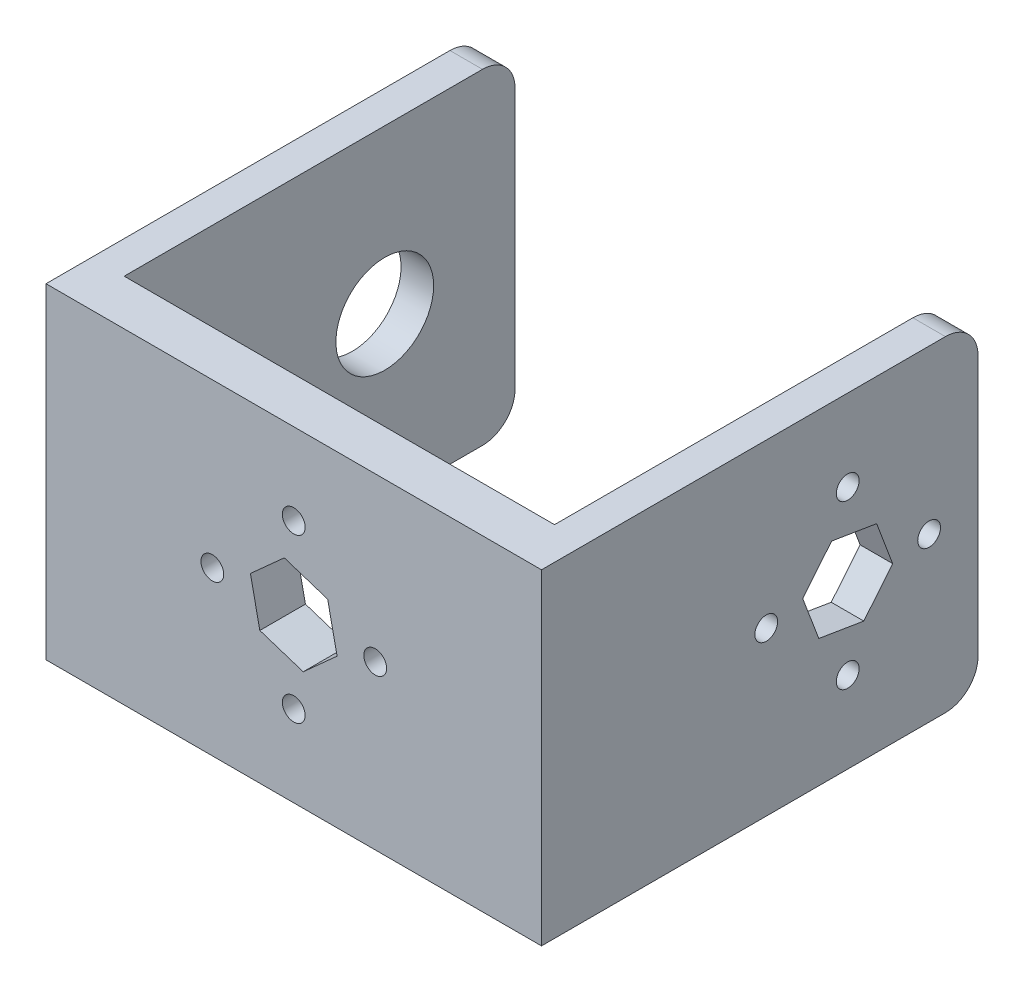
ISO-10303-21;
HEADER;
FILE_DESCRIPTION(('STEP AP214'),'2;1');
FILE_NAME('part.step','',(''),(''),'','','');
FILE_SCHEMA(('AUTOMOTIVE_DESIGN { 1 0 10303 214 1 1 1 1 }'));
ENDSEC;
DATA;
#1=APPLICATION_CONTEXT('core data for automotive mechanical design processes');
#2=APPLICATION_PROTOCOL_DEFINITION('international standard','automotive_design',2000,#1);
#3=PRODUCT_CONTEXT('',#1,'mechanical');
#4=PRODUCT('Part','Part','',(#3));
#5=PRODUCT_RELATED_PRODUCT_CATEGORY('part','',(#4));
#6=PRODUCT_DEFINITION_FORMATION('','',#4);
#7=PRODUCT_DEFINITION_CONTEXT('part definition',#1,'design');
#8=PRODUCT_DEFINITION('design','',#6,#7);
#9=PRODUCT_DEFINITION_SHAPE('','',#8);
#10=(LENGTH_UNIT() NAMED_UNIT(*) SI_UNIT(.MILLI.,.METRE.));
#11=(NAMED_UNIT(*) PLANE_ANGLE_UNIT() SI_UNIT($,.RADIAN.));
#12=(NAMED_UNIT(*) SI_UNIT($,.STERADIAN.) SOLID_ANGLE_UNIT());
#13=UNCERTAINTY_MEASURE_WITH_UNIT(LENGTH_MEASURE(1.E-05),#10,'distance_accuracy_value','');
#14=(GEOMETRIC_REPRESENTATION_CONTEXT(3) GLOBAL_UNCERTAINTY_ASSIGNED_CONTEXT((#13)) GLOBAL_UNIT_ASSIGNED_CONTEXT((#10,
#11,#12)) REPRESENTATION_CONTEXT('',''));
#15=CARTESIAN_POINT('',(0.,0.,0.));
#16=DIRECTION('',(0.,0.,1.));
#17=DIRECTION('',(1.,0.,0.));
#18=AXIS2_PLACEMENT_3D('',#15,#16,#17);
#19=CARTESIAN_POINT('',(-33.03,50.,0.));
#20=DIRECTION('',(-1.,0.,0.));
#21=DIRECTION('',(0.,0.,1.));
#22=AXIS2_PLACEMENT_3D('',#19,#20,#21);
#23=PLANE('',#22);
#24=CARTESIAN_POINT('',(-33.03,25.,-40.));
#25=DIRECTION('',(1.,0.,0.));
#26=DIRECTION('',(0.,0.,-1.));
#27=AXIS2_PLACEMENT_3D('',#24,#25,#26);
#28=CIRCLE('',#27,7.5);
#29=CARTESIAN_POINT('',(-33.03,25.,-47.5));
#30=VERTEX_POINT('',#29);
#31=EDGE_CURVE('E294',#30,#30,#28,.T.);
#32=ORIENTED_EDGE('',*,*,#31,.F.);
#33=EDGE_LOOP('',(#32));
#34=FACE_BOUND('',#33,.T.);
#35=DIRECTION('',(0.,-1.,0.));
#36=VECTOR('',#35,1.);
#37=CARTESIAN_POINT('',(-33.03,50.,-60.));
#38=LINE('',#37,#36);
#39=CARTESIAN_POINT('',(-33.03,45.,-60.));
#40=VERTEX_POINT('',#39);
#41=CARTESIAN_POINT('',(-33.03,5.,-60.));
#42=VERTEX_POINT('',#41);
#43=EDGE_CURVE('E345',#40,#42,#38,.T.);
#44=ORIENTED_EDGE('',*,*,#43,.F.);
#45=CARTESIAN_POINT('',(-33.03,45.,-55.));
#46=DIRECTION('',(-1.,0.,0.));
#47=DIRECTION('',(0.,0.,1.));
#48=AXIS2_PLACEMENT_3D('',#45,#46,#47);
#49=CIRCLE('',#48,5.);
#50=CARTESIAN_POINT('',(-33.03,50.,-55.));
#51=VERTEX_POINT('',#50);
#52=EDGE_CURVE('E368',#40,#51,#49,.F.);
#53=ORIENTED_EDGE('',*,*,#52,.T.);
#54=DIRECTION('',(0.,0.,-1.));
#55=VECTOR('',#54,1.);
#56=CARTESIAN_POINT('',(-33.03,50.,0.));
#57=LINE('',#56,#55);
#58=CARTESIAN_POINT('',(-33.03,50.,0.));
#59=VERTEX_POINT('',#58);
#60=EDGE_CURVE('E304',#59,#51,#57,.T.);
#61=ORIENTED_EDGE('',*,*,#60,.F.);
#62=DIRECTION('',(0.,-1.,0.));
#63=VECTOR('',#62,1.);
#64=CARTESIAN_POINT('',(-33.03,50.,0.));
#65=LINE('',#64,#63);
#66=CARTESIAN_POINT('',(-33.03,0.,0.));
#67=VERTEX_POINT('',#66);
#68=EDGE_CURVE('E348',#59,#67,#65,.T.);
#69=ORIENTED_EDGE('',*,*,#68,.T.);
#70=DIRECTION('',(0.,0.,-1.));
#71=VECTOR('',#70,1.);
#72=CARTESIAN_POINT('',(-33.03,0.,0.));
#73=LINE('',#72,#71);
#74=CARTESIAN_POINT('',(-33.03,0.,-55.));
#75=VERTEX_POINT('',#74);
#76=EDGE_CURVE('E300',#67,#75,#73,.T.);
#77=ORIENTED_EDGE('',*,*,#76,.T.);
#78=CARTESIAN_POINT('',(-33.03,5.,-55.));
#79=DIRECTION('',(-1.,0.,0.));
#80=DIRECTION('',(0.,0.,1.));
#81=AXIS2_PLACEMENT_3D('',#78,#79,#80);
#82=CIRCLE('',#81,5.);
#83=EDGE_CURVE('E366',#75,#42,#82,.F.);
#84=ORIENTED_EDGE('',*,*,#83,.T.);
#85=EDGE_LOOP('',(#44,#53,#61,#69,#77,#84));
#86=FACE_BOUND('',#85,.T.);
#87=ADVANCED_FACE('F40',(#34,#86),#23,.F.);
#88=CARTESIAN_POINT('',(-33.03,50.,-60.));
#89=DIRECTION('',(0.,0.,1.));
#90=DIRECTION('',(1.,0.,0.));
#91=AXIS2_PLACEMENT_3D('',#88,#89,#90);
#92=PLANE('',#91);
#93=DIRECTION('',(0.,-1.,0.));
#94=VECTOR('',#93,1.);
#95=CARTESIAN_POINT('',(-38.03,50.,-60.));
#96=LINE('',#95,#94);
#97=CARTESIAN_POINT('',(-38.03,45.,-60.));
#98=VERTEX_POINT('',#97);
#99=CARTESIAN_POINT('',(-38.03,5.,-60.));
#100=VERTEX_POINT('',#99);
#101=EDGE_CURVE('E342',#98,#100,#96,.T.);
#102=ORIENTED_EDGE('',*,*,#101,.F.);
#103=DIRECTION('',(-1.,0.,0.));
#104=VECTOR('',#103,1.);
#105=CARTESIAN_POINT('',(-33.03,45.,-60.));
#106=LINE('',#105,#104);
#107=EDGE_CURVE('E364',#98,#40,#106,.F.);
#108=ORIENTED_EDGE('',*,*,#107,.T.);
#109=ORIENTED_EDGE('',*,*,#43,.T.);
#110=DIRECTION('',(-1.,0.,0.));
#111=VECTOR('',#110,1.);
#112=CARTESIAN_POINT('',(-38.03,5.,-60.));
#113=LINE('',#112,#111);
#114=EDGE_CURVE('E361',#42,#100,#113,.T.);
#115=ORIENTED_EDGE('',*,*,#114,.T.);
#116=EDGE_LOOP('',(#102,#108,#109,#115));
#117=FACE_BOUND('',#116,.T.);
#118=ADVANCED_FACE('F395',(#117),#92,.F.);
#119=CARTESIAN_POINT('',(-38.03,50.,-60.));
#120=DIRECTION('',(1.,0.,0.));
#121=DIRECTION('',(0.,0.,-1.));
#122=AXIS2_PLACEMENT_3D('',#119,#120,#121);
#123=PLANE('',#122);
#124=CARTESIAN_POINT('',(-38.03,25.,-40.));
#125=DIRECTION('',(1.,0.,0.));
#126=DIRECTION('',(0.,0.,-1.));
#127=AXIS2_PLACEMENT_3D('',#124,#125,#126);
#128=CIRCLE('',#127,7.5);
#129=CARTESIAN_POINT('',(-38.03,25.,-47.5));
#130=VERTEX_POINT('',#129);
#131=EDGE_CURVE('E297',#130,#130,#128,.F.);
#132=ORIENTED_EDGE('',*,*,#131,.F.);
#133=EDGE_LOOP('',(#132));
#134=FACE_BOUND('',#133,.T.);
#135=DIRECTION('',(0.,0.,1.));
#136=VECTOR('',#135,1.);
#137=CARTESIAN_POINT('',(-38.03,50.,-60.));
#138=LINE('',#137,#136);
#139=CARTESIAN_POINT('',(-38.03,50.,-55.));
#140=VERTEX_POINT('',#139);
#141=CARTESIAN_POINT('',(-38.03,50.,7.00000000000001));
#142=VERTEX_POINT('',#141);
#143=EDGE_CURVE('E308',#140,#142,#138,.T.);
#144=ORIENTED_EDGE('',*,*,#143,.F.);
#145=CARTESIAN_POINT('',(-38.03,45.,-55.));
#146=DIRECTION('',(1.,0.,0.));
#147=DIRECTION('',(0.,0.,-1.));
#148=AXIS2_PLACEMENT_3D('',#145,#146,#147);
#149=CIRCLE('',#148,5.);
#150=EDGE_CURVE('E359',#140,#98,#149,.F.);
#151=ORIENTED_EDGE('',*,*,#150,.T.);
#152=ORIENTED_EDGE('',*,*,#101,.T.);
#153=CARTESIAN_POINT('',(-38.03,5.,-55.));
#154=DIRECTION('',(1.,0.,0.));
#155=DIRECTION('',(0.,0.,-1.));
#156=AXIS2_PLACEMENT_3D('',#153,#154,#155);
#157=CIRCLE('',#156,5.);
#158=CARTESIAN_POINT('',(-38.03,0.,-55.));
#159=VERTEX_POINT('',#158);
#160=EDGE_CURVE('E357',#100,#159,#157,.F.);
#161=ORIENTED_EDGE('',*,*,#160,.T.);
#162=DIRECTION('',(0.,0.,1.));
#163=VECTOR('',#162,1.);
#164=CARTESIAN_POINT('',(-38.03,0.,-60.));
#165=LINE('',#164,#163);
#166=CARTESIAN_POINT('',(-38.03,0.,7.00000000000001));
#167=VERTEX_POINT('',#166);
#168=EDGE_CURVE('E320',#159,#167,#165,.T.);
#169=ORIENTED_EDGE('',*,*,#168,.T.);
#170=DIRECTION('',(0.,-1.,0.));
#171=VECTOR('',#170,1.);
#172=CARTESIAN_POINT('',(-38.03,50.,7.00000000000001));
#173=LINE('',#172,#171);
#174=EDGE_CURVE('E339',#142,#167,#173,.T.);
#175=ORIENTED_EDGE('',*,*,#174,.F.);
#176=EDGE_LOOP('',(#144,#151,#152,#161,#169,#175));
#177=FACE_BOUND('',#176,.T.);
#178=ADVANCED_FACE('F399',(#134,#177),#123,.F.);
#179=CARTESIAN_POINT('',(-38.03,50.,7.00000000000001));
#180=DIRECTION('',(0.,0.,-1.));
#181=DIRECTION('',(-1.,0.,0.));
#182=AXIS2_PLACEMENT_3D('',#179,#180,#181);
#183=PLANE('',#182);
#184=CARTESIAN_POINT('',(0.,12.5,7.00000000000001));
#185=DIRECTION('',(0.,0.,-1.));
#186=DIRECTION('',(-1.,0.,0.));
#187=AXIS2_PLACEMENT_3D('',#184,#185,#186);
#188=CIRCLE('',#187,1.75);
#189=CARTESIAN_POINT('',(-1.75,12.5,7.00000000000001));
#190=VERTEX_POINT('',#189);
#191=EDGE_CURVE('E774',#190,#190,#188,.F.);
#192=ORIENTED_EDGE('',*,*,#191,.F.);
#193=EDGE_LOOP('',(#192));
#194=FACE_BOUND('',#193,.T.);
#195=CARTESIAN_POINT('',(-12.5,25.,7.00000000000001));
#196=DIRECTION('',(0.,0.,-1.));
#197=DIRECTION('',(-1.,0.,0.));
#198=AXIS2_PLACEMENT_3D('',#195,#196,#197);
#199=CIRCLE('',#198,1.75);
#200=CARTESIAN_POINT('',(-14.25,25.,7.00000000000001));
#201=VERTEX_POINT('',#200);
#202=EDGE_CURVE('E783',#201,#201,#199,.F.);
#203=ORIENTED_EDGE('',*,*,#202,.F.);
#204=EDGE_LOOP('',(#203));
#205=FACE_BOUND('',#204,.T.);
#206=CARTESIAN_POINT('',(0.,37.5,7.00000000000001));
#207=DIRECTION('',(0.,0.,-1.));
#208=DIRECTION('',(-1.,0.,0.));
#209=AXIS2_PLACEMENT_3D('',#206,#207,#208);
#210=CIRCLE('',#209,1.75);
#211=CARTESIAN_POINT('',(-1.75,37.5,7.00000000000001));
#212=VERTEX_POINT('',#211);
#213=EDGE_CURVE('E789',#212,#212,#210,.F.);
#214=ORIENTED_EDGE('',*,*,#213,.F.);
#215=EDGE_LOOP('',(#214));
#216=FACE_BOUND('',#215,.T.);
#217=CARTESIAN_POINT('',(12.5,25.,7.00000000000001));
#218=DIRECTION('',(0.,0.,-1.));
#219=DIRECTION('',(-1.,0.,0.));
#220=AXIS2_PLACEMENT_3D('',#217,#218,#219);
#221=CIRCLE('',#220,1.75);
#222=CARTESIAN_POINT('',(10.75,25.,7.00000000000001));
#223=VERTEX_POINT('',#222);
#224=EDGE_CURVE('E795',#223,#223,#221,.F.);
#225=ORIENTED_EDGE('',*,*,#224,.F.);
#226=EDGE_LOOP('',(#225));
#227=FACE_BOUND('',#226,.T.);
#228=DIRECTION('',(-0.743500583183184,-0.668735286048423,0.));
#229=VECTOR('',#228,1.);
#230=CARTESIAN_POINT('',(-6.65624426401605,27.1666592481868,7.00000000000001));
#231=LINE('',#230,#229);
#232=CARTESIAN_POINT('',(-1.45174018173376,31.8478062505258,7.00000000000001));
#233=VERTEX_POINT('',#232);
#234=CARTESIAN_POINT('',(-6.65624426401605,27.1666592481868,7.00000000000001));
#235=VERTEX_POINT('',#234);
#236=EDGE_CURVE('E828',#233,#235,#231,.T.);
#237=ORIENTED_EDGE('',*,*,#236,.F.);
#238=DIRECTION('',(-0.95089203771658,0.30952274974097,0.));
#239=VECTOR('',#238,1.);
#240=CARTESIAN_POINT('',(-1.45174018173376,31.8478062505258,7.00000000000001));
#241=LINE('',#240,#239);
#242=CARTESIAN_POINT('',(5.20450408228229,29.681147002339,7.00000000000001));
#243=VERTEX_POINT('',#242);
#244=EDGE_CURVE('E251',#243,#233,#241,.T.);
#245=ORIENTED_EDGE('',*,*,#244,.F.);
#246=DIRECTION('',(-0.207391454533395,0.978258035789394,0.));
#247=VECTOR('',#246,1.);
#248=CARTESIAN_POINT('',(5.20450408228229,29.681147002339,7.00000000000001));
#249=LINE('',#248,#247);
#250=CARTESIAN_POINT('',(6.65624426401605,22.8333407518132,7.00000000000001));
#251=VERTEX_POINT('',#250);
#252=EDGE_CURVE('E248',#251,#243,#249,.T.);
#253=ORIENTED_EDGE('',*,*,#252,.F.);
#254=DIRECTION('',(0.743500583183183,0.668735286048423,0.));
#255=VECTOR('',#254,1.);
#256=CARTESIAN_POINT('',(6.65624426401606,22.8333407518132,7.00000000000001));
#257=LINE('',#256,#255);
#258=CARTESIAN_POINT('',(1.45174018173378,18.1521937494742,7.00000000000001));
#259=VERTEX_POINT('',#258);
#260=EDGE_CURVE('E210',#259,#251,#257,.T.);
#261=ORIENTED_EDGE('',*,*,#260,.F.);
#262=DIRECTION('',(0.950892037716579,-0.309522749740971,0.));
#263=VECTOR('',#262,1.);
#264=CARTESIAN_POINT('',(1.45174018173378,18.1521937494742,7.00000000000001));
#265=LINE('',#264,#263);
#266=CARTESIAN_POINT('',(-5.20450408228228,20.318852997661,7.00000000000001));
#267=VERTEX_POINT('',#266);
#268=EDGE_CURVE('E824',#267,#259,#265,.T.);
#269=ORIENTED_EDGE('',*,*,#268,.F.);
#270=DIRECTION('',(0.207391454533396,-0.978258035789394,0.));
#271=VECTOR('',#270,1.);
#272=CARTESIAN_POINT('',(-5.20450408228228,20.318852997661,7.00000000000001));
#273=LINE('',#272,#271);
#274=EDGE_CURVE('E826',#235,#267,#273,.T.);
#275=ORIENTED_EDGE('',*,*,#274,.F.);
#276=EDGE_LOOP('',(#237,#245,#253,#261,#269,#275));
#277=FACE_BOUND('',#276,.T.);
#278=DIRECTION('',(1.,0.,0.));
#279=VECTOR('',#278,1.);
#280=CARTESIAN_POINT('',(-38.03,0.,7.00000000000001));
#281=LINE('',#280,#279);
#282=CARTESIAN_POINT('',(38.03,0.,7.00000000000001));
#283=VERTEX_POINT('',#282);
#284=EDGE_CURVE('E322',#167,#283,#281,.T.);
#285=ORIENTED_EDGE('',*,*,#284,.T.);
#286=DIRECTION('',(0.,-1.,0.));
#287=VECTOR('',#286,1.);
#288=CARTESIAN_POINT('',(38.03,50.,7.00000000000001));
#289=LINE('',#288,#287);
#290=CARTESIAN_POINT('',(38.03,50.,7.00000000000001));
#291=VERTEX_POINT('',#290);
#292=EDGE_CURVE('E336',#291,#283,#289,.T.);
#293=ORIENTED_EDGE('',*,*,#292,.F.);
#294=DIRECTION('',(1.,0.,0.));
#295=VECTOR('',#294,1.);
#296=CARTESIAN_POINT('',(-38.03,50.,7.00000000000001));
#297=LINE('',#296,#295);
#298=EDGE_CURVE('E310',#142,#291,#297,.T.);
#299=ORIENTED_EDGE('',*,*,#298,.F.);
#300=ORIENTED_EDGE('',*,*,#174,.T.);
#301=EDGE_LOOP('',(#285,#293,#299,#300));
#302=FACE_BOUND('',#301,.T.);
#303=ADVANCED_FACE('F428',(#194,#205,#216,#227,#277,#302),#183,.F.);
#304=CARTESIAN_POINT('',(38.03,50.,-60.));
#305=DIRECTION('',(-1.,0.,0.));
#306=DIRECTION('',(0.,0.,1.));
#307=AXIS2_PLACEMENT_3D('',#304,#305,#306);
#308=PLANE('',#307);
#309=CARTESIAN_POINT('',(38.03,25.,-27.5));
#310=DIRECTION('',(-1.,0.,0.));
#311=DIRECTION('',(0.,0.,1.));
#312=AXIS2_PLACEMENT_3D('',#309,#310,#311);
#313=CIRCLE('',#312,1.75);
#314=CARTESIAN_POINT('',(38.03,25.,-25.75));
#315=VERTEX_POINT('',#314);
#316=EDGE_CURVE('E803',#315,#315,#313,.F.);
#317=ORIENTED_EDGE('',*,*,#316,.F.);
#318=EDGE_LOOP('',(#317));
#319=FACE_BOUND('',#318,.T.);
#320=CARTESIAN_POINT('',(38.03,12.5,-40.));
#321=DIRECTION('',(-1.,0.,0.));
#322=DIRECTION('',(0.,0.,1.));
#323=AXIS2_PLACEMENT_3D('',#320,#321,#322);
#324=CIRCLE('',#323,1.75);
#325=CARTESIAN_POINT('',(38.03,12.5,-38.25));
#326=VERTEX_POINT('',#325);
#327=EDGE_CURVE('E807',#326,#326,#324,.F.);
#328=ORIENTED_EDGE('',*,*,#327,.F.);
#329=EDGE_LOOP('',(#328));
#330=FACE_BOUND('',#329,.T.);
#331=CARTESIAN_POINT('',(38.03,25.,-52.5));
#332=DIRECTION('',(-1.,0.,0.));
#333=DIRECTION('',(0.,0.,1.));
#334=AXIS2_PLACEMENT_3D('',#331,#332,#333);
#335=CIRCLE('',#334,1.75);
#336=CARTESIAN_POINT('',(38.03,25.,-50.75));
#337=VERTEX_POINT('',#336);
#338=EDGE_CURVE('E813',#337,#337,#335,.F.);
#339=ORIENTED_EDGE('',*,*,#338,.F.);
#340=EDGE_LOOP('',(#339));
#341=FACE_BOUND('',#340,.T.);
#342=CARTESIAN_POINT('',(38.03,37.5,-40.));
#343=DIRECTION('',(-1.,0.,0.));
#344=DIRECTION('',(0.,0.,1.));
#345=AXIS2_PLACEMENT_3D('',#342,#343,#344);
#346=CIRCLE('',#345,1.75);
#347=CARTESIAN_POINT('',(38.03,37.5,-38.25));
#348=VERTEX_POINT('',#347);
#349=EDGE_CURVE('E780',#348,#348,#346,.F.);
#350=ORIENTED_EDGE('',*,*,#349,.F.);
#351=EDGE_LOOP('',(#350));
#352=FACE_BOUND('',#351,.T.);
#353=DIRECTION('',(0.,0.162325167758954,0.986737320623897));
#354=VECTOR('',#353,1.);
#355=CARTESIAN_POINT('',(38.03,31.5499151928138,-37.5304634104861));
#356=LINE('',#355,#354);
#357=CARTESIAN_POINT('',(38.03,30.4136390185011,-44.4376246548534));
#358=VERTEX_POINT('',#357);
#359=CARTESIAN_POINT('',(38.03,31.5499151928138,-37.5304634104861));
#360=VERTEX_POINT('',#359);
#361=EDGE_CURVE('E260',#358,#360,#356,.T.);
#362=ORIENTED_EDGE('',*,*,#361,.F.);
#363=DIRECTION('',(0.,0.935702170401963,0.352790941359123));
#364=VECTOR('',#363,1.);
#365=CARTESIAN_POINT('',(38.03,30.4136390185011,-44.4376246548534));
#366=LINE('',#365,#364);
#367=CARTESIAN_POINT('',(38.03,23.8637238256873,-46.9071612443673));
#368=VERTEX_POINT('',#367);
#369=EDGE_CURVE('E262',#368,#358,#366,.T.);
#370=ORIENTED_EDGE('',*,*,#369,.F.);
#371=DIRECTION('',(0.,0.773377002643008,-0.633946379264774));
#372=VECTOR('',#371,1.);
#373=CARTESIAN_POINT('',(38.03,23.8637238256873,-46.9071612443673));
#374=LINE('',#373,#372);
#375=CARTESIAN_POINT('',(38.03,18.4500848071863,-42.4695365895138));
#376=VERTEX_POINT('',#375);
#377=EDGE_CURVE('E264',#376,#368,#374,.T.);
#378=ORIENTED_EDGE('',*,*,#377,.F.);
#379=DIRECTION('',(0.,-0.162325167758954,-0.986737320623897));
#380=VECTOR('',#379,1.);
#381=CARTESIAN_POINT('',(38.03,18.4500848071863,-42.4695365895138));
#382=LINE('',#381,#380);
#383=CARTESIAN_POINT('',(38.03,19.5863609814989,-35.5623753451466));
#384=VERTEX_POINT('',#383);
#385=EDGE_CURVE('E252',#384,#376,#382,.T.);
#386=ORIENTED_EDGE('',*,*,#385,.F.);
#387=DIRECTION('',(0.,-0.935702170401963,-0.352790941359123));
#388=VECTOR('',#387,1.);
#389=CARTESIAN_POINT('',(38.03,19.5863609814989,-35.5623753451466));
#390=LINE('',#389,#388);
#391=CARTESIAN_POINT('',(38.03,26.1362761743127,-33.0928387556327));
#392=VERTEX_POINT('',#391);
#393=EDGE_CURVE('E255',#392,#384,#390,.T.);
#394=ORIENTED_EDGE('',*,*,#393,.F.);
#395=DIRECTION('',(0.,-0.773377002643009,0.633946379264773));
#396=VECTOR('',#395,1.);
#397=CARTESIAN_POINT('',(38.03,26.1362761743127,-33.0928387556327));
#398=LINE('',#397,#396);
#399=EDGE_CURVE('E258',#360,#392,#398,.T.);
#400=ORIENTED_EDGE('',*,*,#399,.F.);
#401=EDGE_LOOP('',(#362,#370,#378,#386,#394,#400));
#402=FACE_BOUND('',#401,.T.);
#403=DIRECTION('',(0.,-1.,0.));
#404=VECTOR('',#403,1.);
#405=CARTESIAN_POINT('',(38.03,50.,-60.));
#406=LINE('',#405,#404);
#407=CARTESIAN_POINT('',(38.03,45.,-60.));
#408=VERTEX_POINT('',#407);
#409=CARTESIAN_POINT('',(38.03,5.,-60.));
#410=VERTEX_POINT('',#409);
#411=EDGE_CURVE('E334',#408,#410,#406,.T.);
#412=ORIENTED_EDGE('',*,*,#411,.F.);
#413=CARTESIAN_POINT('',(38.03,45.,-55.));
#414=DIRECTION('',(-1.,0.,0.));
#415=DIRECTION('',(0.,0.,1.));
#416=AXIS2_PLACEMENT_3D('',#413,#414,#415);
#417=CIRCLE('',#416,5.);
#418=CARTESIAN_POINT('',(38.03,50.,-55.));
#419=VERTEX_POINT('',#418);
#420=EDGE_CURVE('E380',#408,#419,#417,.F.);
#421=ORIENTED_EDGE('',*,*,#420,.T.);
#422=DIRECTION('',(0.,0.,-1.));
#423=VECTOR('',#422,1.);
#424=CARTESIAN_POINT('',(38.03,50.,-60.));
#425=LINE('',#424,#423);
#426=EDGE_CURVE('E312',#291,#419,#425,.T.);
#427=ORIENTED_EDGE('',*,*,#426,.F.);
#428=ORIENTED_EDGE('',*,*,#292,.T.);
#429=DIRECTION('',(0.,0.,-1.));
#430=VECTOR('',#429,1.);
#431=CARTESIAN_POINT('',(38.03,0.,-60.));
#432=LINE('',#431,#430);
#433=CARTESIAN_POINT('',(38.03,0.,-55.));
#434=VERTEX_POINT('',#433);
#435=EDGE_CURVE('E324',#283,#434,#432,.T.);
#436=ORIENTED_EDGE('',*,*,#435,.T.);
#437=CARTESIAN_POINT('',(38.03,5.,-55.));
#438=DIRECTION('',(-1.,0.,0.));
#439=DIRECTION('',(0.,0.,1.));
#440=AXIS2_PLACEMENT_3D('',#437,#438,#439);
#441=CIRCLE('',#440,5.);
#442=EDGE_CURVE('E60',#434,#410,#441,.F.);
#443=ORIENTED_EDGE('',*,*,#442,.T.);
#444=EDGE_LOOP('',(#412,#421,#427,#428,#436,#443));
#445=FACE_BOUND('',#444,.T.);
#446=ADVANCED_FACE('F426',(#319,#330,#341,#352,#402,#445),#308,.F.);
#447=CARTESIAN_POINT('',(33.03,50.,-60.));
#448=DIRECTION('',(0.,0.,1.));
#449=DIRECTION('',(1.,0.,0.));
#450=AXIS2_PLACEMENT_3D('',#447,#448,#449);
#451=PLANE('',#450);
#452=DIRECTION('',(0.,-1.,0.));
#453=VECTOR('',#452,1.);
#454=CARTESIAN_POINT('',(33.03,50.,-60.));
#455=LINE('',#454,#453);
#456=CARTESIAN_POINT('',(33.03,45.,-60.));
#457=VERTEX_POINT('',#456);
#458=CARTESIAN_POINT('',(33.03,5.,-60.));
#459=VERTEX_POINT('',#458);
#460=EDGE_CURVE('E331',#457,#459,#455,.T.);
#461=ORIENTED_EDGE('',*,*,#460,.F.);
#462=DIRECTION('',(-1.,0.,0.));
#463=VECTOR('',#462,1.);
#464=CARTESIAN_POINT('',(33.03,45.,-60.));
#465=LINE('',#464,#463);
#466=EDGE_CURVE('E377',#457,#408,#465,.F.);
#467=ORIENTED_EDGE('',*,*,#466,.T.);
#468=ORIENTED_EDGE('',*,*,#411,.T.);
#469=DIRECTION('',(-1.,0.,0.));
#470=VECTOR('',#469,1.);
#471=CARTESIAN_POINT('',(33.03,5.,-60.));
#472=LINE('',#471,#470);
#473=EDGE_CURVE('E374',#410,#459,#472,.T.);
#474=ORIENTED_EDGE('',*,*,#473,.T.);
#475=EDGE_LOOP('',(#461,#467,#468,#474));
#476=FACE_BOUND('',#475,.T.);
#477=ADVANCED_FACE('F416',(#476),#451,.F.);
#478=CARTESIAN_POINT('',(33.03,50.,0.));
#479=DIRECTION('',(1.,0.,0.));
#480=DIRECTION('',(0.,0.,-1.));
#481=AXIS2_PLACEMENT_3D('',#478,#479,#480);
#482=PLANE('',#481);
#483=CARTESIAN_POINT('',(33.03,25.,-27.5));
#484=DIRECTION('',(-1.,0.,0.));
#485=DIRECTION('',(0.,0.,1.));
#486=AXIS2_PLACEMENT_3D('',#483,#484,#485);
#487=CIRCLE('',#486,1.75);
#488=CARTESIAN_POINT('',(33.03,25.,-25.75));
#489=VERTEX_POINT('',#488);
#490=EDGE_CURVE('E800',#489,#489,#487,.T.);
#491=ORIENTED_EDGE('',*,*,#490,.F.);
#492=EDGE_LOOP('',(#491));
#493=FACE_BOUND('',#492,.T.);
#494=CARTESIAN_POINT('',(33.03,12.5,-40.));
#495=DIRECTION('',(-1.,0.,0.));
#496=DIRECTION('',(0.,0.,1.));
#497=AXIS2_PLACEMENT_3D('',#494,#495,#496);
#498=CIRCLE('',#497,1.75);
#499=CARTESIAN_POINT('',(33.03,12.5,-38.25));
#500=VERTEX_POINT('',#499);
#501=EDGE_CURVE('E804',#500,#500,#498,.T.);
#502=ORIENTED_EDGE('',*,*,#501,.F.);
#503=EDGE_LOOP('',(#502));
#504=FACE_BOUND('',#503,.T.);
#505=CARTESIAN_POINT('',(33.03,25.,-52.5));
#506=DIRECTION('',(-1.,0.,0.));
#507=DIRECTION('',(0.,0.,1.));
#508=AXIS2_PLACEMENT_3D('',#505,#506,#507);
#509=CIRCLE('',#508,1.75);
#510=CARTESIAN_POINT('',(33.03,25.,-50.75));
#511=VERTEX_POINT('',#510);
#512=EDGE_CURVE('E810',#511,#511,#509,.T.);
#513=ORIENTED_EDGE('',*,*,#512,.F.);
#514=EDGE_LOOP('',(#513));
#515=FACE_BOUND('',#514,.T.);
#516=CARTESIAN_POINT('',(33.03,37.5,-40.));
#517=DIRECTION('',(-1.,0.,0.));
#518=DIRECTION('',(0.,0.,1.));
#519=AXIS2_PLACEMENT_3D('',#516,#517,#518);
#520=CIRCLE('',#519,1.75);
#521=CARTESIAN_POINT('',(33.03,37.5,-38.25));
#522=VERTEX_POINT('',#521);
#523=EDGE_CURVE('E816',#522,#522,#520,.T.);
#524=ORIENTED_EDGE('',*,*,#523,.F.);
#525=EDGE_LOOP('',(#524));
#526=FACE_BOUND('',#525,.T.);
#527=DIRECTION('',(0.,-0.773377002643008,0.633946379264774));
#528=VECTOR('',#527,1.);
#529=CARTESIAN_POINT('',(33.03,23.8637238256873,-46.9071612443673));
#530=LINE('',#529,#528);
#531=CARTESIAN_POINT('',(33.03,23.8637238256873,-46.9071612443673));
#532=VERTEX_POINT('',#531);
#533=CARTESIAN_POINT('',(33.03,18.4500848071863,-42.4695365895138));
#534=VERTEX_POINT('',#533);
#535=EDGE_CURVE('E266',#532,#534,#530,.T.);
#536=ORIENTED_EDGE('',*,*,#535,.F.);
#537=DIRECTION('',(0.,-0.935702170401963,-0.352790941359123));
#538=VECTOR('',#537,1.);
#539=CARTESIAN_POINT('',(33.03,30.4136390185011,-44.4376246548534));
#540=LINE('',#539,#538);
#541=CARTESIAN_POINT('',(33.03,30.4136390185011,-44.4376246548534));
#542=VERTEX_POINT('',#541);
#543=EDGE_CURVE('E250',#542,#532,#540,.T.);
#544=ORIENTED_EDGE('',*,*,#543,.F.);
#545=DIRECTION('',(0.,-0.162325167758954,-0.986737320623897));
#546=VECTOR('',#545,1.);
#547=CARTESIAN_POINT('',(33.03,31.5499151928138,-37.5304634104861));
#548=LINE('',#547,#546);
#549=CARTESIAN_POINT('',(33.03,31.5499151928138,-37.5304634104861));
#550=VERTEX_POINT('',#549);
#551=EDGE_CURVE('E278',#550,#542,#548,.T.);
#552=ORIENTED_EDGE('',*,*,#551,.F.);
#553=DIRECTION('',(0.,0.773377002643009,-0.633946379264774));
#554=VECTOR('',#553,1.);
#555=CARTESIAN_POINT('',(33.03,26.1362761743127,-33.0928387556327));
#556=LINE('',#555,#554);
#557=CARTESIAN_POINT('',(33.03,26.1362761743127,-33.0928387556327));
#558=VERTEX_POINT('',#557);
#559=EDGE_CURVE('E275',#558,#550,#556,.T.);
#560=ORIENTED_EDGE('',*,*,#559,.F.);
#561=DIRECTION('',(0.,0.935702170401963,0.352790941359123));
#562=VECTOR('',#561,1.);
#563=CARTESIAN_POINT('',(33.03,19.5863609814989,-35.5623753451466));
#564=LINE('',#563,#562);
#565=CARTESIAN_POINT('',(33.03,19.5863609814989,-35.5623753451466));
#566=VERTEX_POINT('',#565);
#567=EDGE_CURVE('E272',#566,#558,#564,.T.);
#568=ORIENTED_EDGE('',*,*,#567,.F.);
#569=DIRECTION('',(0.,0.162325167758954,0.986737320623897));
#570=VECTOR('',#569,1.);
#571=CARTESIAN_POINT('',(33.03,18.4500848071863,-42.4695365895138));
#572=LINE('',#571,#570);
#573=EDGE_CURVE('E269',#534,#566,#572,.T.);
#574=ORIENTED_EDGE('',*,*,#573,.F.);
#575=EDGE_LOOP('',(#536,#544,#552,#560,#568,#574));
#576=FACE_BOUND('',#575,.T.);
#577=DIRECTION('',(0.,0.,1.));
#578=VECTOR('',#577,1.);
#579=CARTESIAN_POINT('',(33.03,50.,0.));
#580=LINE('',#579,#578);
#581=CARTESIAN_POINT('',(33.03,50.,-55.));
#582=VERTEX_POINT('',#581);
#583=CARTESIAN_POINT('',(33.03,50.,0.));
#584=VERTEX_POINT('',#583);
#585=EDGE_CURVE('E315',#582,#584,#580,.T.);
#586=ORIENTED_EDGE('',*,*,#585,.F.);
#587=CARTESIAN_POINT('',(33.03,45.,-55.));
#588=DIRECTION('',(1.,0.,0.));
#589=DIRECTION('',(0.,0.,-1.));
#590=AXIS2_PLACEMENT_3D('',#587,#588,#589);
#591=CIRCLE('',#590,5.);
#592=EDGE_CURVE('E372',#582,#457,#591,.F.);
#593=ORIENTED_EDGE('',*,*,#592,.T.);
#594=ORIENTED_EDGE('',*,*,#460,.T.);
#595=CARTESIAN_POINT('',(33.03,5.,-55.));
#596=DIRECTION('',(1.,0.,0.));
#597=DIRECTION('',(0.,0.,-1.));
#598=AXIS2_PLACEMENT_3D('',#595,#596,#597);
#599=CIRCLE('',#598,5.);
#600=CARTESIAN_POINT('',(33.03,0.,-55.));
#601=VERTEX_POINT('',#600);
#602=EDGE_CURVE('E370',#459,#601,#599,.F.);
#603=ORIENTED_EDGE('',*,*,#602,.T.);
#604=DIRECTION('',(0.,0.,1.));
#605=VECTOR('',#604,1.);
#606=CARTESIAN_POINT('',(33.03,0.,0.));
#607=LINE('',#606,#605);
#608=CARTESIAN_POINT('',(33.03,0.,0.));
#609=VERTEX_POINT('',#608);
#610=EDGE_CURVE('E326',#601,#609,#607,.T.);
#611=ORIENTED_EDGE('',*,*,#610,.T.);
#612=DIRECTION('',(0.,-1.,0.));
#613=VECTOR('',#612,1.);
#614=CARTESIAN_POINT('',(33.03,50.,0.));
#615=LINE('',#614,#613);
#616=EDGE_CURVE('E317',#584,#609,#615,.T.);
#617=ORIENTED_EDGE('',*,*,#616,.F.);
#618=EDGE_LOOP('',(#586,#593,#594,#603,#611,#617));
#619=FACE_BOUND('',#618,.T.);
#620=ADVANCED_FACE('F418',(#493,#504,#515,#526,#576,#619),#482,.F.);
#621=CARTESIAN_POINT('',(0.,50.,0.));
#622=DIRECTION('',(0.,0.,1.));
#623=DIRECTION('',(1.,0.,0.));
#624=AXIS2_PLACEMENT_3D('',#621,#622,#623);
#625=PLANE('',#624);
#626=CARTESIAN_POINT('',(0.,12.5,0.));
#627=DIRECTION('',(0.,0.,-1.));
#628=DIRECTION('',(-1.,0.,0.));
#629=AXIS2_PLACEMENT_3D('',#626,#627,#628);
#630=CIRCLE('',#629,1.75);
#631=CARTESIAN_POINT('',(-1.75,12.5,0.));
#632=VERTEX_POINT('',#631);
#633=EDGE_CURVE('E777',#632,#632,#630,.T.);
#634=ORIENTED_EDGE('',*,*,#633,.F.);
#635=EDGE_LOOP('',(#634));
#636=FACE_BOUND('',#635,.T.);
#637=CARTESIAN_POINT('',(-12.5,25.,0.));
#638=DIRECTION('',(0.,0.,-1.));
#639=DIRECTION('',(-1.,0.,0.));
#640=AXIS2_PLACEMENT_3D('',#637,#638,#639);
#641=CIRCLE('',#640,1.75);
#642=CARTESIAN_POINT('',(-14.25,25.,0.));
#643=VERTEX_POINT('',#642);
#644=EDGE_CURVE('E778',#643,#643,#641,.T.);
#645=ORIENTED_EDGE('',*,*,#644,.F.);
#646=EDGE_LOOP('',(#645));
#647=FACE_BOUND('',#646,.T.);
#648=CARTESIAN_POINT('',(0.,37.5,0.));
#649=DIRECTION('',(0.,0.,-1.));
#650=DIRECTION('',(-1.,0.,0.));
#651=AXIS2_PLACEMENT_3D('',#648,#649,#650);
#652=CIRCLE('',#651,1.75);
#653=CARTESIAN_POINT('',(-1.75,37.5,0.));
#654=VERTEX_POINT('',#653);
#655=EDGE_CURVE('E787',#654,#654,#652,.T.);
#656=ORIENTED_EDGE('',*,*,#655,.F.);
#657=EDGE_LOOP('',(#656));
#658=FACE_BOUND('',#657,.T.);
#659=CARTESIAN_POINT('',(12.5,25.,0.));
#660=DIRECTION('',(0.,0.,-1.));
#661=DIRECTION('',(-1.,0.,0.));
#662=AXIS2_PLACEMENT_3D('',#659,#660,#661);
#663=CIRCLE('',#662,1.75);
#664=CARTESIAN_POINT('',(10.75,25.,0.));
#665=VERTEX_POINT('',#664);
#666=EDGE_CURVE('E792',#665,#665,#663,.T.);
#667=ORIENTED_EDGE('',*,*,#666,.F.);
#668=EDGE_LOOP('',(#667));
#669=FACE_BOUND('',#668,.T.);
#670=DIRECTION('',(0.207391454533395,-0.978258035789394,0.));
#671=VECTOR('',#670,1.);
#672=CARTESIAN_POINT('',(5.20450408228229,29.681147002339,0.));
#673=LINE('',#672,#671);
#674=CARTESIAN_POINT('',(5.20450408228229,29.681147002339,0.));
#675=VERTEX_POINT('',#674);
#676=CARTESIAN_POINT('',(6.65624426401606,22.8333407518132,0.));
#677=VERTEX_POINT('',#676);
#678=EDGE_CURVE('E218',#675,#677,#673,.T.);
#679=ORIENTED_EDGE('',*,*,#678,.F.);
#680=DIRECTION('',(0.950892037716579,-0.30952274974097,0.));
#681=VECTOR('',#680,1.);
#682=CARTESIAN_POINT('',(-1.45174018173376,31.8478062505258,0.));
#683=LINE('',#682,#681);
#684=CARTESIAN_POINT('',(-1.45174018173376,31.8478062505258,0.));
#685=VERTEX_POINT('',#684);
#686=EDGE_CURVE('E223',#685,#675,#683,.T.);
#687=ORIENTED_EDGE('',*,*,#686,.F.);
#688=DIRECTION('',(0.743500583183184,0.668735286048423,0.));
#689=VECTOR('',#688,1.);
#690=CARTESIAN_POINT('',(-6.65624426401605,27.1666592481868,0.));
#691=LINE('',#690,#689);
#692=CARTESIAN_POINT('',(-6.65624426401605,27.1666592481868,0.));
#693=VERTEX_POINT('',#692);
#694=EDGE_CURVE('E237',#693,#685,#691,.T.);
#695=ORIENTED_EDGE('',*,*,#694,.F.);
#696=DIRECTION('',(-0.207391454533396,0.978258035789394,0.));
#697=VECTOR('',#696,1.);
#698=CARTESIAN_POINT('',(-5.20450408228228,20.318852997661,0.));
#699=LINE('',#698,#697);
#700=CARTESIAN_POINT('',(-5.20450408228228,20.318852997661,0.));
#701=VERTEX_POINT('',#700);
#702=EDGE_CURVE('E231',#701,#693,#699,.T.);
#703=ORIENTED_EDGE('',*,*,#702,.F.);
#704=DIRECTION('',(-0.950892037716579,0.309522749740971,0.));
#705=VECTOR('',#704,1.);
#706=CARTESIAN_POINT('',(1.45174018173378,18.1521937494742,0.));
#707=LINE('',#706,#705);
#708=CARTESIAN_POINT('',(1.45174018173378,18.1521937494742,0.));
#709=VERTEX_POINT('',#708);
#710=EDGE_CURVE('E229',#709,#701,#707,.T.);
#711=ORIENTED_EDGE('',*,*,#710,.F.);
#712=DIRECTION('',(-0.743500583183183,-0.668735286048423,0.));
#713=VECTOR('',#712,1.);
#714=CARTESIAN_POINT('',(6.65624426401606,22.8333407518132,0.));
#715=LINE('',#714,#713);
#716=EDGE_CURVE('E207',#677,#709,#715,.T.);
#717=ORIENTED_EDGE('',*,*,#716,.F.);
#718=EDGE_LOOP('',(#679,#687,#695,#703,#711,#717));
#719=FACE_BOUND('',#718,.T.);
#720=DIRECTION('',(-1.,0.,0.));
#721=VECTOR('',#720,1.);
#722=CARTESIAN_POINT('',(0.,0.,0.));
#723=LINE('',#722,#721);
#724=EDGE_CURVE('E305',#609,#67,#723,.T.);
#725=ORIENTED_EDGE('',*,*,#724,.T.);
#726=ORIENTED_EDGE('',*,*,#68,.F.);
#727=DIRECTION('',(-1.,0.,0.));
#728=VECTOR('',#727,1.);
#729=CARTESIAN_POINT('',(0.,50.,0.));
#730=LINE('',#729,#728);
#731=EDGE_CURVE('E301',#584,#59,#730,.T.);
#732=ORIENTED_EDGE('',*,*,#731,.F.);
#733=ORIENTED_EDGE('',*,*,#616,.T.);
#734=EDGE_LOOP('',(#725,#726,#732,#733));
#735=FACE_BOUND('',#734,.T.);
#736=ADVANCED_FACE('F225',(#636,#647,#658,#669,#719,#735),#625,.F.);
#737=CARTESIAN_POINT('',(0.,50.,0.));
#738=DIRECTION('',(0.,-1.,0.));
#739=DIRECTION('',(0.,0.,-1.));
#740=AXIS2_PLACEMENT_3D('',#737,#738,#739);
#741=PLANE('',#740);
#742=ORIENTED_EDGE('',*,*,#60,.T.);
#743=DIRECTION('',(-1.,0.,0.));
#744=VECTOR('',#743,1.);
#745=CARTESIAN_POINT('',(0.,50.,-55.));
#746=LINE('',#745,#744);
#747=EDGE_CURVE('E354',#51,#140,#746,.T.);
#748=ORIENTED_EDGE('',*,*,#747,.T.);
#749=ORIENTED_EDGE('',*,*,#143,.T.);
#750=ORIENTED_EDGE('',*,*,#298,.T.);
#751=ORIENTED_EDGE('',*,*,#426,.T.);
#752=DIRECTION('',(-1.,0.,0.));
#753=VECTOR('',#752,1.);
#754=CARTESIAN_POINT('',(0.,50.,-55.));
#755=LINE('',#754,#753);
#756=EDGE_CURVE('E351',#419,#582,#755,.T.);
#757=ORIENTED_EDGE('',*,*,#756,.T.);
#758=ORIENTED_EDGE('',*,*,#585,.T.);
#759=ORIENTED_EDGE('',*,*,#731,.T.);
#760=EDGE_LOOP('',(#742,#748,#749,#750,#751,#757,#758,#759));
#761=FACE_BOUND('',#760,.T.);
#762=ADVANCED_FACE('F406',(#761),#741,.F.);
#763=CARTESIAN_POINT('',(0.,0.,0.));
#764=DIRECTION('',(0.,-1.,0.));
#765=DIRECTION('',(0.,0.,-1.));
#766=AXIS2_PLACEMENT_3D('',#763,#764,#765);
#767=PLANE('',#766);
#768=ORIENTED_EDGE('',*,*,#610,.F.);
#769=DIRECTION('',(-1.,0.,0.));
#770=VECTOR('',#769,1.);
#771=CARTESIAN_POINT('',(38.03,0.,-55.));
#772=LINE('',#771,#770);
#773=EDGE_CURVE('E11',#601,#434,#772,.F.);
#774=ORIENTED_EDGE('',*,*,#773,.T.);
#775=ORIENTED_EDGE('',*,*,#435,.F.);
#776=ORIENTED_EDGE('',*,*,#284,.F.);
#777=ORIENTED_EDGE('',*,*,#168,.F.);
#778=DIRECTION('',(-1.,0.,0.));
#779=VECTOR('',#778,1.);
#780=CARTESIAN_POINT('',(-33.03,0.,-55.));
#781=LINE('',#780,#779);
#782=EDGE_CURVE('E48',#159,#75,#781,.F.);
#783=ORIENTED_EDGE('',*,*,#782,.T.);
#784=ORIENTED_EDGE('',*,*,#76,.F.);
#785=ORIENTED_EDGE('',*,*,#724,.F.);
#786=EDGE_LOOP('',(#768,#774,#775,#776,#777,#783,#784,#785));
#787=FACE_BOUND('',#786,.T.);
#788=ADVANCED_FACE('F384',(#787),#767,.T.);
#789=CARTESIAN_POINT('',(-59.2432034355964,25.,-40.));
#790=DIRECTION('',(1.,0.,0.));
#791=DIRECTION('',(0.,0.,-1.));
#792=AXIS2_PLACEMENT_3D('',#789,#790,#791);
#793=CYLINDRICAL_SURFACE('',#792,7.5);
#794=ORIENTED_EDGE('',*,*,#131,.T.);
#795=EDGE_LOOP('',(#794));
#796=FACE_BOUND('',#795,.T.);
#797=ORIENTED_EDGE('',*,*,#31,.T.);
#798=EDGE_LOOP('',(#797));
#799=FACE_BOUND('',#798,.T.);
#800=ADVANCED_FACE('F490',(#796,#799),#793,.F.);
#801=CARTESIAN_POINT('',(57.0678849128512,30.4136390185011,-44.4376246548534));
#802=DIRECTION('',(0.,0.352790941359123,-0.935702170401963));
#803=DIRECTION('',(0.,0.935702170401963,0.352790941359123));
#804=AXIS2_PLACEMENT_3D('',#801,#802,#803);
#805=PLANE('',#804);
#806=ORIENTED_EDGE('',*,*,#369,.T.);
#807=DIRECTION('',(-1.,0.,0.));
#808=VECTOR('',#807,1.);
#809=CARTESIAN_POINT('',(57.0678849128512,30.4136390185011,-44.4376246548534));
#810=LINE('',#809,#808);
#811=EDGE_CURVE('E256',#358,#542,#810,.T.);
#812=ORIENTED_EDGE('',*,*,#811,.T.);
#813=ORIENTED_EDGE('',*,*,#543,.T.);
#814=DIRECTION('',(-1.,0.,0.));
#815=VECTOR('',#814,1.);
#816=CARTESIAN_POINT('',(57.0678849128512,23.8637238256873,-46.9071612443673));
#817=LINE('',#816,#815);
#818=EDGE_CURVE('E281',#368,#532,#817,.T.);
#819=ORIENTED_EDGE('',*,*,#818,.F.);
#820=EDGE_LOOP('',(#806,#812,#813,#819));
#821=FACE_BOUND('',#820,.T.);
#822=ADVANCED_FACE('F563',(#821),#805,.F.);
#823=CARTESIAN_POINT('',(57.0678849128512,31.5499151928138,-37.5304634104861));
#824=DIRECTION('',(0.,0.986737320623897,-0.162325167758954));
#825=DIRECTION('',(0.,0.162325167758954,0.986737320623897));
#826=AXIS2_PLACEMENT_3D('',#823,#824,#825);
#827=PLANE('',#826);
#828=ORIENTED_EDGE('',*,*,#361,.T.);
#829=DIRECTION('',(-1.,0.,0.));
#830=VECTOR('',#829,1.);
#831=CARTESIAN_POINT('',(57.0678849128512,31.5499151928138,-37.5304634104861));
#832=LINE('',#831,#830);
#833=EDGE_CURVE('E283',#360,#550,#832,.T.);
#834=ORIENTED_EDGE('',*,*,#833,.T.);
#835=ORIENTED_EDGE('',*,*,#551,.T.);
#836=ORIENTED_EDGE('',*,*,#811,.F.);
#837=EDGE_LOOP('',(#828,#834,#835,#836));
#838=FACE_BOUND('',#837,.T.);
#839=ADVANCED_FACE('F572',(#838),#827,.F.);
#840=CARTESIAN_POINT('',(57.0678849128512,26.1362761743127,-33.0928387556327));
#841=DIRECTION('',(0.,0.633946379264773,0.773377002643009));
#842=DIRECTION('',(0.,-0.773377002643009,0.633946379264773));
#843=AXIS2_PLACEMENT_3D('',#840,#841,#842);
#844=PLANE('',#843);
#845=ORIENTED_EDGE('',*,*,#399,.T.);
#846=DIRECTION('',(-1.,0.,0.));
#847=VECTOR('',#846,1.);
#848=CARTESIAN_POINT('',(57.0678849128512,26.1362761743127,-33.0928387556327));
#849=LINE('',#848,#847);
#850=EDGE_CURVE('E285',#392,#558,#849,.T.);
#851=ORIENTED_EDGE('',*,*,#850,.T.);
#852=ORIENTED_EDGE('',*,*,#559,.T.);
#853=ORIENTED_EDGE('',*,*,#833,.F.);
#854=EDGE_LOOP('',(#845,#851,#852,#853));
#855=FACE_BOUND('',#854,.T.);
#856=ADVANCED_FACE('F581',(#855),#844,.F.);
#857=CARTESIAN_POINT('',(57.0678849128512,19.5863609814989,-35.5623753451466));
#858=DIRECTION('',(0.,-0.352790941359123,0.935702170401963));
#859=DIRECTION('',(0.,-0.935702170401963,-0.352790941359123));
#860=AXIS2_PLACEMENT_3D('',#857,#858,#859);
#861=PLANE('',#860);
#862=ORIENTED_EDGE('',*,*,#393,.T.);
#863=DIRECTION('',(-1.,0.,0.));
#864=VECTOR('',#863,1.);
#865=CARTESIAN_POINT('',(57.0678849128512,19.5863609814989,-35.5623753451466));
#866=LINE('',#865,#864);
#867=EDGE_CURVE('E287',#384,#566,#866,.T.);
#868=ORIENTED_EDGE('',*,*,#867,.T.);
#869=ORIENTED_EDGE('',*,*,#567,.T.);
#870=ORIENTED_EDGE('',*,*,#850,.F.);
#871=EDGE_LOOP('',(#862,#868,#869,#870));
#872=FACE_BOUND('',#871,.T.);
#873=ADVANCED_FACE('F590',(#872),#861,.F.);
#874=CARTESIAN_POINT('',(57.0678849128512,18.4500848071863,-42.4695365895138));
#875=DIRECTION('',(0.,-0.986737320623897,0.162325167758954));
#876=DIRECTION('',(0.,-0.162325167758954,-0.986737320623897));
#877=AXIS2_PLACEMENT_3D('',#874,#875,#876);
#878=PLANE('',#877);
#879=ORIENTED_EDGE('',*,*,#385,.T.);
#880=DIRECTION('',(-1.,0.,0.));
#881=VECTOR('',#880,1.);
#882=CARTESIAN_POINT('',(57.0678849128512,18.4500848071863,-42.4695365895138));
#883=LINE('',#882,#881);
#884=EDGE_CURVE('E289',#376,#534,#883,.T.);
#885=ORIENTED_EDGE('',*,*,#884,.T.);
#886=ORIENTED_EDGE('',*,*,#573,.T.);
#887=ORIENTED_EDGE('',*,*,#867,.F.);
#888=EDGE_LOOP('',(#879,#885,#886,#887));
#889=FACE_BOUND('',#888,.T.);
#890=ADVANCED_FACE('F599',(#889),#878,.F.);
#891=CARTESIAN_POINT('',(57.0678849128512,23.8637238256873,-46.9071612443673));
#892=DIRECTION('',(0.,-0.633946379264774,-0.773377002643008));
#893=DIRECTION('',(0.,0.773377002643008,-0.633946379264774));
#894=AXIS2_PLACEMENT_3D('',#891,#892,#893);
#895=PLANE('',#894);
#896=ORIENTED_EDGE('',*,*,#377,.T.);
#897=ORIENTED_EDGE('',*,*,#818,.T.);
#898=ORIENTED_EDGE('',*,*,#535,.T.);
#899=ORIENTED_EDGE('',*,*,#884,.F.);
#900=EDGE_LOOP('',(#896,#897,#898,#899));
#901=FACE_BOUND('',#900,.T.);
#902=ADVANCED_FACE('F608',(#901),#895,.F.);
#903=CARTESIAN_POINT('',(-1.45174018173376,31.8478062505258,26.0995327845459));
#904=DIRECTION('',(0.30952274974097,0.95089203771658,0.));
#905=DIRECTION('',(-0.95089203771658,0.30952274974097,0.));
#906=AXIS2_PLACEMENT_3D('',#903,#904,#905);
#907=PLANE('',#906);
#908=ORIENTED_EDGE('',*,*,#244,.T.);
#909=DIRECTION('',(0.,0.,-1.));
#910=VECTOR('',#909,1.);
#911=CARTESIAN_POINT('',(-1.45174018173376,31.8478062505258,26.0995327845459));
#912=LINE('',#911,#910);
#913=EDGE_CURVE('E240',#233,#685,#912,.T.);
#914=ORIENTED_EDGE('',*,*,#913,.T.);
#915=ORIENTED_EDGE('',*,*,#686,.T.);
#916=DIRECTION('',(0.,0.,-1.));
#917=VECTOR('',#916,1.);
#918=CARTESIAN_POINT('',(5.20450408228229,29.681147002339,26.0995327845459));
#919=LINE('',#918,#917);
#920=EDGE_CURVE('E214',#243,#675,#919,.T.);
#921=ORIENTED_EDGE('',*,*,#920,.F.);
#922=EDGE_LOOP('',(#908,#914,#915,#921));
#923=FACE_BOUND('',#922,.T.);
#924=ADVANCED_FACE('F617',(#923),#907,.F.);
#925=CARTESIAN_POINT('',(-6.65624426401605,27.1666592481868,26.0995327845459));
#926=DIRECTION('',(-0.668735286048423,0.743500583183184,0.));
#927=DIRECTION('',(-0.743500583183184,-0.668735286048423,0.));
#928=AXIS2_PLACEMENT_3D('',#925,#926,#927);
#929=PLANE('',#928);
#930=ORIENTED_EDGE('',*,*,#236,.T.);
#931=DIRECTION('',(0.,0.,-1.));
#932=VECTOR('',#931,1.);
#933=CARTESIAN_POINT('',(-6.65624426401605,27.1666592481868,26.0995327845459));
#934=LINE('',#933,#932);
#935=EDGE_CURVE('E242',#235,#693,#934,.T.);
#936=ORIENTED_EDGE('',*,*,#935,.T.);
#937=ORIENTED_EDGE('',*,*,#694,.T.);
#938=ORIENTED_EDGE('',*,*,#913,.F.);
#939=EDGE_LOOP('',(#930,#936,#937,#938));
#940=FACE_BOUND('',#939,.T.);
#941=ADVANCED_FACE('F626',(#940),#929,.F.);
#942=CARTESIAN_POINT('',(-5.20450408228228,20.318852997661,26.0995327845459));
#943=DIRECTION('',(-0.978258035789394,-0.207391454533396,0.));
#944=DIRECTION('',(0.207391454533396,-0.978258035789394,0.));
#945=AXIS2_PLACEMENT_3D('',#942,#943,#944);
#946=PLANE('',#945);
#947=ORIENTED_EDGE('',*,*,#274,.T.);
#948=DIRECTION('',(0.,0.,-1.));
#949=VECTOR('',#948,1.);
#950=CARTESIAN_POINT('',(-5.20450408228228,20.318852997661,26.0995327845459));
#951=LINE('',#950,#949);
#952=EDGE_CURVE('E244',#267,#701,#951,.T.);
#953=ORIENTED_EDGE('',*,*,#952,.T.);
#954=ORIENTED_EDGE('',*,*,#702,.T.);
#955=ORIENTED_EDGE('',*,*,#935,.F.);
#956=EDGE_LOOP('',(#947,#953,#954,#955));
#957=FACE_BOUND('',#956,.T.);
#958=ADVANCED_FACE('F635',(#957),#946,.F.);
#959=CARTESIAN_POINT('',(1.45174018173378,18.1521937494742,26.0995327845459));
#960=DIRECTION('',(-0.309522749740971,-0.950892037716579,0.));
#961=DIRECTION('',(0.950892037716579,-0.309522749740971,0.));
#962=AXIS2_PLACEMENT_3D('',#959,#960,#961);
#963=PLANE('',#962);
#964=ORIENTED_EDGE('',*,*,#268,.T.);
#965=DIRECTION('',(0.,0.,-1.));
#966=VECTOR('',#965,1.);
#967=CARTESIAN_POINT('',(1.45174018173378,18.1521937494742,26.0995327845459));
#968=LINE('',#967,#966);
#969=EDGE_CURVE('E213',#259,#709,#968,.T.);
#970=ORIENTED_EDGE('',*,*,#969,.T.);
#971=ORIENTED_EDGE('',*,*,#710,.T.);
#972=ORIENTED_EDGE('',*,*,#952,.F.);
#973=EDGE_LOOP('',(#964,#970,#971,#972));
#974=FACE_BOUND('',#973,.T.);
#975=ADVANCED_FACE('F644',(#974),#963,.F.);
#976=CARTESIAN_POINT('',(6.65624426401606,22.8333407518132,26.0995327845459));
#977=DIRECTION('',(0.668735286048423,-0.743500583183183,0.));
#978=DIRECTION('',(0.743500583183183,0.668735286048423,0.));
#979=AXIS2_PLACEMENT_3D('',#976,#977,#978);
#980=PLANE('',#979);
#981=ORIENTED_EDGE('',*,*,#260,.T.);
#982=DIRECTION('',(0.,0.,-1.));
#983=VECTOR('',#982,1.);
#984=CARTESIAN_POINT('',(6.65624426401606,22.8333407518132,26.0995327845459));
#985=LINE('',#984,#983);
#986=EDGE_CURVE('E202',#251,#677,#985,.T.);
#987=ORIENTED_EDGE('',*,*,#986,.T.);
#988=ORIENTED_EDGE('',*,*,#716,.T.);
#989=ORIENTED_EDGE('',*,*,#969,.F.);
#990=EDGE_LOOP('',(#981,#987,#988,#989));
#991=FACE_BOUND('',#990,.T.);
#992=ADVANCED_FACE('F204',(#991),#980,.F.);
#993=CARTESIAN_POINT('',(5.20450408228229,29.681147002339,26.0995327845459));
#994=DIRECTION('',(0.978258035789394,0.207391454533395,0.));
#995=DIRECTION('',(-0.207391454533395,0.978258035789394,0.));
#996=AXIS2_PLACEMENT_3D('',#993,#994,#995);
#997=PLANE('',#996);
#998=ORIENTED_EDGE('',*,*,#252,.T.);
#999=ORIENTED_EDGE('',*,*,#920,.T.);
#1000=ORIENTED_EDGE('',*,*,#678,.T.);
#1001=ORIENTED_EDGE('',*,*,#986,.F.);
#1002=EDGE_LOOP('',(#998,#999,#1000,#1001));
#1003=FACE_BOUND('',#1002,.T.);
#1004=ADVANCED_FACE('F219',(#1003),#997,.F.);
#1005=CARTESIAN_POINT('',(42.9797474683058,37.5,-40.));
#1006=DIRECTION('',(-1.,0.,0.));
#1007=DIRECTION('',(0.,0.,1.));
#1008=AXIS2_PLACEMENT_3D('',#1005,#1006,#1007);
#1009=CYLINDRICAL_SURFACE('',#1008,1.75);
#1010=ORIENTED_EDGE('',*,*,#349,.T.);
#1011=EDGE_LOOP('',(#1010));
#1012=FACE_BOUND('',#1011,.T.);
#1013=ORIENTED_EDGE('',*,*,#523,.T.);
#1014=EDGE_LOOP('',(#1013));
#1015=FACE_BOUND('',#1014,.T.);
#1016=ADVANCED_FACE('F668',(#1012,#1015),#1009,.F.);
#1017=CARTESIAN_POINT('',(42.9797474683058,25.,-52.5));
#1018=DIRECTION('',(-1.,0.,0.));
#1019=DIRECTION('',(0.,0.,1.));
#1020=AXIS2_PLACEMENT_3D('',#1017,#1018,#1019);
#1021=CYLINDRICAL_SURFACE('',#1020,1.75);
#1022=ORIENTED_EDGE('',*,*,#338,.T.);
#1023=EDGE_LOOP('',(#1022));
#1024=FACE_BOUND('',#1023,.T.);
#1025=ORIENTED_EDGE('',*,*,#512,.T.);
#1026=EDGE_LOOP('',(#1025));
#1027=FACE_BOUND('',#1026,.T.);
#1028=ADVANCED_FACE('F676',(#1024,#1027),#1021,.F.);
#1029=CARTESIAN_POINT('',(42.9797474683058,12.5,-40.));
#1030=DIRECTION('',(-1.,0.,0.));
#1031=DIRECTION('',(0.,0.,1.));
#1032=AXIS2_PLACEMENT_3D('',#1029,#1030,#1031);
#1033=CYLINDRICAL_SURFACE('',#1032,1.75);
#1034=ORIENTED_EDGE('',*,*,#327,.T.);
#1035=EDGE_LOOP('',(#1034));
#1036=FACE_BOUND('',#1035,.T.);
#1037=ORIENTED_EDGE('',*,*,#501,.T.);
#1038=EDGE_LOOP('',(#1037));
#1039=FACE_BOUND('',#1038,.T.);
#1040=ADVANCED_FACE('F686',(#1036,#1039),#1033,.F.);
#1041=CARTESIAN_POINT('',(42.9797474683058,25.,-27.5));
#1042=DIRECTION('',(-1.,0.,0.));
#1043=DIRECTION('',(0.,0.,1.));
#1044=AXIS2_PLACEMENT_3D('',#1041,#1042,#1043);
#1045=CYLINDRICAL_SURFACE('',#1044,1.75);
#1046=ORIENTED_EDGE('',*,*,#316,.T.);
#1047=EDGE_LOOP('',(#1046));
#1048=FACE_BOUND('',#1047,.T.);
#1049=ORIENTED_EDGE('',*,*,#490,.T.);
#1050=EDGE_LOOP('',(#1049));
#1051=FACE_BOUND('',#1050,.T.);
#1052=ADVANCED_FACE('F696',(#1048,#1051),#1045,.F.);
#1053=CARTESIAN_POINT('',(12.5,25.,11.9497474683058));
#1054=DIRECTION('',(0.,0.,-1.));
#1055=DIRECTION('',(-1.,0.,0.));
#1056=AXIS2_PLACEMENT_3D('',#1053,#1054,#1055);
#1057=CYLINDRICAL_SURFACE('',#1056,1.75);
#1058=ORIENTED_EDGE('',*,*,#224,.T.);
#1059=EDGE_LOOP('',(#1058));
#1060=FACE_BOUND('',#1059,.T.);
#1061=ORIENTED_EDGE('',*,*,#666,.T.);
#1062=EDGE_LOOP('',(#1061));
#1063=FACE_BOUND('',#1062,.T.);
#1064=ADVANCED_FACE('F705',(#1060,#1063),#1057,.F.);
#1065=CARTESIAN_POINT('',(0.,37.5,11.9497474683058));
#1066=DIRECTION('',(0.,0.,-1.));
#1067=DIRECTION('',(-1.,0.,0.));
#1068=AXIS2_PLACEMENT_3D('',#1065,#1066,#1067);
#1069=CYLINDRICAL_SURFACE('',#1068,1.75);
#1070=ORIENTED_EDGE('',*,*,#213,.T.);
#1071=EDGE_LOOP('',(#1070));
#1072=FACE_BOUND('',#1071,.T.);
#1073=ORIENTED_EDGE('',*,*,#655,.T.);
#1074=EDGE_LOOP('',(#1073));
#1075=FACE_BOUND('',#1074,.T.);
#1076=ADVANCED_FACE('F714',(#1072,#1075),#1069,.F.);
#1077=CARTESIAN_POINT('',(-12.5,25.,11.9497474683058));
#1078=DIRECTION('',(0.,0.,-1.));
#1079=DIRECTION('',(-1.,0.,0.));
#1080=AXIS2_PLACEMENT_3D('',#1077,#1078,#1079);
#1081=CYLINDRICAL_SURFACE('',#1080,1.75);
#1082=ORIENTED_EDGE('',*,*,#202,.T.);
#1083=EDGE_LOOP('',(#1082));
#1084=FACE_BOUND('',#1083,.T.);
#1085=ORIENTED_EDGE('',*,*,#644,.T.);
#1086=EDGE_LOOP('',(#1085));
#1087=FACE_BOUND('',#1086,.T.);
#1088=ADVANCED_FACE('F724',(#1084,#1087),#1081,.F.);
#1089=CARTESIAN_POINT('',(0.,12.5,11.9497474683058));
#1090=DIRECTION('',(0.,0.,-1.));
#1091=DIRECTION('',(-1.,0.,0.));
#1092=AXIS2_PLACEMENT_3D('',#1089,#1090,#1091);
#1093=CYLINDRICAL_SURFACE('',#1092,1.75);
#1094=ORIENTED_EDGE('',*,*,#191,.T.);
#1095=EDGE_LOOP('',(#1094));
#1096=FACE_BOUND('',#1095,.T.);
#1097=ORIENTED_EDGE('',*,*,#633,.T.);
#1098=EDGE_LOOP('',(#1097));
#1099=FACE_BOUND('',#1098,.T.);
#1100=ADVANCED_FACE('F456',(#1096,#1099),#1093,.F.);
#1101=CARTESIAN_POINT('',(0.,45.,-55.));
#1102=DIRECTION('',(-1.,0.,0.));
#1103=DIRECTION('',(0.,0.,1.));
#1104=AXIS2_PLACEMENT_3D('',#1101,#1102,#1103);
#1105=CYLINDRICAL_SURFACE('',#1104,5.);
#1106=ORIENTED_EDGE('',*,*,#52,.F.);
#1107=ORIENTED_EDGE('',*,*,#107,.F.);
#1108=ORIENTED_EDGE('',*,*,#150,.F.);
#1109=ORIENTED_EDGE('',*,*,#747,.F.);
#1110=EDGE_LOOP('',(#1106,#1107,#1108,#1109));
#1111=FACE_BOUND('',#1110,.T.);
#1112=ADVANCED_FACE('F404',(#1111),#1105,.T.);
#1113=CARTESIAN_POINT('',(0.,45.,-55.));
#1114=DIRECTION('',(-1.,0.,0.));
#1115=DIRECTION('',(0.,0.,1.));
#1116=AXIS2_PLACEMENT_3D('',#1113,#1114,#1115);
#1117=CYLINDRICAL_SURFACE('',#1116,5.);
#1118=ORIENTED_EDGE('',*,*,#420,.F.);
#1119=ORIENTED_EDGE('',*,*,#466,.F.);
#1120=ORIENTED_EDGE('',*,*,#592,.F.);
#1121=ORIENTED_EDGE('',*,*,#756,.F.);
#1122=EDGE_LOOP('',(#1118,#1119,#1120,#1121));
#1123=FACE_BOUND('',#1122,.T.);
#1124=ADVANCED_FACE('F422',(#1123),#1117,.T.);
#1125=CARTESIAN_POINT('',(33.03,5.,-55.));
#1126=DIRECTION('',(1.,0.,0.));
#1127=DIRECTION('',(0.,0.,-1.));
#1128=AXIS2_PLACEMENT_3D('',#1125,#1126,#1127);
#1129=CYLINDRICAL_SURFACE('',#1128,5.);
#1130=ORIENTED_EDGE('',*,*,#442,.F.);
#1131=ORIENTED_EDGE('',*,*,#773,.F.);
#1132=ORIENTED_EDGE('',*,*,#602,.F.);
#1133=ORIENTED_EDGE('',*,*,#473,.F.);
#1134=EDGE_LOOP('',(#1130,#1131,#1132,#1133));
#1135=FACE_BOUND('',#1134,.T.);
#1136=ADVANCED_FACE('F412',(#1135),#1129,.T.);
#1137=CARTESIAN_POINT('',(-33.03,5.,-55.));
#1138=DIRECTION('',(1.,0.,0.));
#1139=DIRECTION('',(0.,0.,-1.));
#1140=AXIS2_PLACEMENT_3D('',#1137,#1138,#1139);
#1141=CYLINDRICAL_SURFACE('',#1140,5.);
#1142=ORIENTED_EDGE('',*,*,#83,.F.);
#1143=ORIENTED_EDGE('',*,*,#782,.F.);
#1144=ORIENTED_EDGE('',*,*,#160,.F.);
#1145=ORIENTED_EDGE('',*,*,#114,.F.);
#1146=EDGE_LOOP('',(#1142,#1143,#1144,#1145));
#1147=FACE_BOUND('',#1146,.T.);
#1148=ADVANCED_FACE('F42',(#1147),#1141,.T.);
#1149=CLOSED_SHELL('',(#87,#118,#178,#303,#446,#477,#620,#736,#762,#788,#800,#822,#839,#856,
#873,#890,#902,#924,#941,#958,#975,#992,#1004,#1016,#1028,#1040,#1052,#1064,#1076,#1088,#1100,
#1112,#1124,#1136,#1148));
#1150=MANIFOLD_SOLID_BREP('B2',#1149);
#1151=ADVANCED_BREP_SHAPE_REPRESENTATION('',(#18,#1150),#14);
#1152=SHAPE_DEFINITION_REPRESENTATION(#9,#1151);
ENDSEC;
END-ISO-10303-21;
